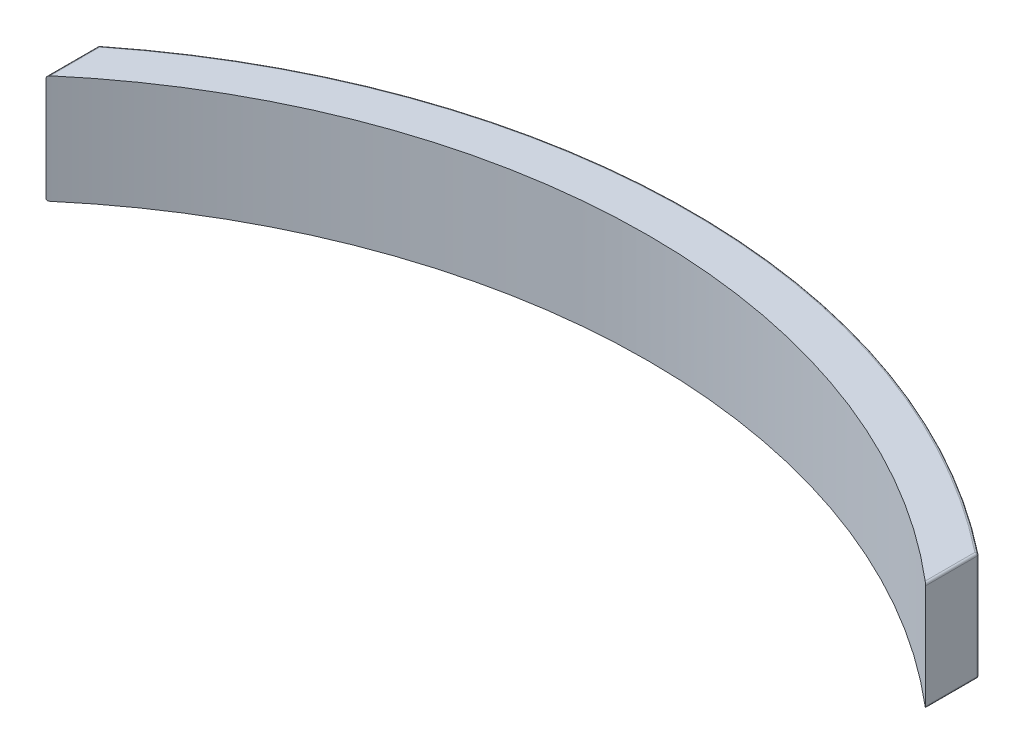
ISO-10303-21;
HEADER;
FILE_DESCRIPTION(('STEP AP214'),'2;1');
FILE_NAME('part.step','',(''),(''),'','','');
FILE_SCHEMA(('AUTOMOTIVE_DESIGN { 1 0 10303 214 1 1 1 1 }'));
ENDSEC;
DATA;
#1=APPLICATION_CONTEXT('core data for automotive mechanical design processes');
#2=APPLICATION_PROTOCOL_DEFINITION('international standard','automotive_design',2000,#1);
#3=PRODUCT_CONTEXT('',#1,'mechanical');
#4=PRODUCT('Part','Part','',(#3));
#5=PRODUCT_RELATED_PRODUCT_CATEGORY('part','',(#4));
#6=PRODUCT_DEFINITION_FORMATION('','',#4);
#7=PRODUCT_DEFINITION_CONTEXT('part definition',#1,'design');
#8=PRODUCT_DEFINITION('design','',#6,#7);
#9=PRODUCT_DEFINITION_SHAPE('','',#8);
#10=(LENGTH_UNIT() NAMED_UNIT(*) SI_UNIT(.MILLI.,.METRE.));
#11=(NAMED_UNIT(*) PLANE_ANGLE_UNIT() SI_UNIT($,.RADIAN.));
#12=(NAMED_UNIT(*) SI_UNIT($,.STERADIAN.) SOLID_ANGLE_UNIT());
#13=UNCERTAINTY_MEASURE_WITH_UNIT(LENGTH_MEASURE(1.E-05),#10,'distance_accuracy_value','');
#14=(GEOMETRIC_REPRESENTATION_CONTEXT(3) GLOBAL_UNCERTAINTY_ASSIGNED_CONTEXT((#13)) GLOBAL_UNIT_ASSIGNED_CONTEXT((#10,
#11,#12)) REPRESENTATION_CONTEXT('',''));
#15=CARTESIAN_POINT('',(0.,0.,0.));
#16=DIRECTION('',(0.,0.,1.));
#17=DIRECTION('',(1.,0.,0.));
#18=AXIS2_PLACEMENT_3D('',#15,#16,#17);
#19=CARTESIAN_POINT('',(51.3662048797983,12.7,-4.15000947331262));
#20=DIRECTION('',(-1.,0.,0.));
#21=DIRECTION('',(0.,0.,1.));
#22=AXIS2_PLACEMENT_3D('',#19,#20,#21);
#23=PLANE('',#22);
#24=DIRECTION('',(0.,1.,0.));
#25=VECTOR('',#24,1.);
#26=CARTESIAN_POINT('',(51.3662048797983,0.,-58.4729008963283));
#27=LINE('',#26,#25);
#28=CARTESIAN_POINT('',(51.3662048797983,0.254000000000001,-58.4729008963283));
#29=VERTEX_POINT('',#28);
#30=CARTESIAN_POINT('',(51.3662048797983,12.446,-58.4729008963283));
#31=VERTEX_POINT('',#30);
#32=EDGE_CURVE('E124',#29,#31,#27,.T.);
#33=ORIENTED_EDGE('',*,*,#32,.F.);
#34=DIRECTION('',(0.,0.,-1.));
#35=VECTOR('',#34,1.);
#36=CARTESIAN_POINT('',(51.3662048797983,0.254000000000001,-64.2973141915476));
#37=LINE('',#36,#35);
#38=CARTESIAN_POINT('',(51.3662048797983,0.254000000000001,-64.4994118448031));
#39=VERTEX_POINT('',#38);
#40=EDGE_CURVE('E258',#29,#39,#37,.T.);
#41=ORIENTED_EDGE('',*,*,#40,.T.);
#42=DIRECTION('',(0.,-1.,0.));
#43=VECTOR('',#42,1.);
#44=CARTESIAN_POINT('',(51.3662048797983,12.7,-64.4994118448031));
#45=LINE('',#44,#43);
#46=CARTESIAN_POINT('',(51.3662048797983,12.446,-64.4994118448031));
#47=VERTEX_POINT('',#46);
#48=EDGE_CURVE('E256',#39,#47,#45,.F.);
#49=ORIENTED_EDGE('',*,*,#48,.T.);
#50=DIRECTION('',(0.,0.,-1.));
#51=VECTOR('',#50,1.);
#52=CARTESIAN_POINT('',(51.3662048797983,12.446,-4.15000947331262));
#53=LINE('',#52,#51);
#54=EDGE_CURVE('E127',#47,#31,#53,.F.);
#55=ORIENTED_EDGE('',*,*,#54,.T.);
#56=EDGE_LOOP('',(#33,#41,#49,#55));
#57=FACE_BOUND('',#56,.T.);
#58=ADVANCED_FACE('F37',(#57),#23,.F.);
#59=CARTESIAN_POINT('',(0.,12.7,0.));
#60=DIRECTION('',(0.,-1.,0.));
#61=DIRECTION('',(0.,0.,-1.));
#62=AXIS2_PLACEMENT_3D('',#59,#60,#61);
#63=CYLINDRICAL_SURFACE('',#62,82.55);
#64=CARTESIAN_POINT('',(0.,0.254000000000001,0.));
#65=DIRECTION('',(0.,-1.,0.));
#66=DIRECTION('',(0.,0.,-1.));
#67=AXIS2_PLACEMENT_3D('',#64,#65,#66);
#68=CIRCLE('',#67,82.55);
#69=CARTESIAN_POINT('',(51.2699585985631,0.254000000000001,-64.6984841035834));
#70=VERTEX_POINT('',#69);
#71=CARTESIAN_POINT('',(-51.269958598563,0.254000000000001,-64.6984841035834));
#72=VERTEX_POINT('',#71);
#73=EDGE_CURVE('E132',#70,#72,#68,.F.);
#74=ORIENTED_EDGE('',*,*,#73,.T.);
#75=DIRECTION('',(0.,-1.,0.));
#76=VECTOR('',#75,1.);
#77=CARTESIAN_POINT('',(-51.269958598563,12.7,-64.6984841035834));
#78=LINE('',#77,#76);
#79=CARTESIAN_POINT('',(-51.269958598563,12.446,-64.6984841035834));
#80=VERTEX_POINT('',#79);
#81=EDGE_CURVE('E260',#72,#80,#78,.F.);
#82=ORIENTED_EDGE('',*,*,#81,.T.);
#83=CARTESIAN_POINT('',(0.,12.446,0.));
#84=DIRECTION('',(0.,-1.,0.));
#85=DIRECTION('',(0.,0.,-1.));
#86=AXIS2_PLACEMENT_3D('',#83,#84,#85);
#87=CIRCLE('',#86,82.55);
#88=CARTESIAN_POINT('',(51.2699585985631,12.446,-64.6984841035834));
#89=VERTEX_POINT('',#88);
#90=EDGE_CURVE('E277',#80,#89,#87,.T.);
#91=ORIENTED_EDGE('',*,*,#90,.T.);
#92=DIRECTION('',(0.,-1.,0.));
#93=VECTOR('',#92,1.);
#94=CARTESIAN_POINT('',(51.2699585985631,12.7,-64.6984841035834));
#95=LINE('',#94,#93);
#96=EDGE_CURVE('E281',#89,#70,#95,.T.);
#97=ORIENTED_EDGE('',*,*,#96,.T.);
#98=EDGE_LOOP('',(#74,#82,#91,#97));
#99=FACE_BOUND('',#98,.T.);
#100=ADVANCED_FACE('F216',(#99),#63,.T.);
#101=CARTESIAN_POINT('',(-51.3662048797982,12.7,-4.15000947331263));
#102=DIRECTION('',(1.,0.,0.));
#103=DIRECTION('',(0.,0.,-1.));
#104=AXIS2_PLACEMENT_3D('',#101,#102,#103);
#105=PLANE('',#104);
#106=DIRECTION('',(0.,-1.,0.));
#107=VECTOR('',#106,1.);
#108=CARTESIAN_POINT('',(-51.3662048797982,12.7,-64.4994118448031));
#109=LINE('',#108,#107);
#110=CARTESIAN_POINT('',(-51.3662048797982,12.446,-64.4994118448031));
#111=VERTEX_POINT('',#110);
#112=CARTESIAN_POINT('',(-51.3662048797982,0.254000000000001,-64.4994118448031));
#113=VERTEX_POINT('',#112);
#114=EDGE_CURVE('E275',#111,#113,#109,.T.);
#115=ORIENTED_EDGE('',*,*,#114,.T.);
#116=DIRECTION('',(0.,0.,1.));
#117=VECTOR('',#116,1.);
#118=CARTESIAN_POINT('',(-51.3662048797982,0.254000000000001,-58.4729008963283));
#119=LINE('',#118,#117);
#120=CARTESIAN_POINT('',(-51.3662048797982,0.254000000000001,-58.4729008963283));
#121=VERTEX_POINT('',#120);
#122=EDGE_CURVE('E247',#113,#121,#119,.T.);
#123=ORIENTED_EDGE('',*,*,#122,.T.);
#124=DIRECTION('',(0.,1.,0.));
#125=VECTOR('',#124,1.);
#126=CARTESIAN_POINT('',(-51.3662048797982,0.,-58.4729008963283));
#127=LINE('',#126,#125);
#128=CARTESIAN_POINT('',(-51.3662048797982,12.446,-58.4729008963283));
#129=VERTEX_POINT('',#128);
#130=EDGE_CURVE('E133',#121,#129,#127,.T.);
#131=ORIENTED_EDGE('',*,*,#130,.T.);
#132=DIRECTION('',(0.,0.,1.));
#133=VECTOR('',#132,1.);
#134=CARTESIAN_POINT('',(-51.3662048797982,12.446,-4.15000947331263));
#135=LINE('',#134,#133);
#136=EDGE_CURVE('E126',#129,#111,#135,.F.);
#137=ORIENTED_EDGE('',*,*,#136,.T.);
#138=EDGE_LOOP('',(#115,#123,#131,#137));
#139=FACE_BOUND('',#138,.T.);
#140=ADVANCED_FACE('F222',(#139),#105,.F.);
#141=CARTESIAN_POINT('',(0.,12.7,0.));
#142=DIRECTION('',(0.,-1.,0.));
#143=DIRECTION('',(0.,0.,-1.));
#144=AXIS2_PLACEMENT_3D('',#141,#142,#143);
#145=PLANE('',#144);
#146=DIRECTION('',(0.,0.,-1.));
#147=VECTOR('',#146,1.);
#148=CARTESIAN_POINT('',(51.1122048797983,12.7,0.));
#149=LINE('',#148,#147);
#150=CARTESIAN_POINT('',(51.1122048797983,12.7,-58.6899288749966));
#151=VERTEX_POINT('',#150);
#152=CARTESIAN_POINT('',(51.1122048797983,12.7,-64.4994118448031));
#153=VERTEX_POINT('',#152);
#154=EDGE_CURVE('E130',#151,#153,#149,.T.);
#155=ORIENTED_EDGE('',*,*,#154,.T.);
#156=CARTESIAN_POINT('',(0.,12.7,0.));
#157=DIRECTION('',(0.,-1.,0.));
#158=DIRECTION('',(0.,0.,-1.));
#159=AXIS2_PLACEMENT_3D('',#156,#157,#158);
#160=CIRCLE('',#159,82.296);
#161=CARTESIAN_POINT('',(-51.1122048797982,12.7,-64.4994118448031));
#162=VERTEX_POINT('',#161);
#163=EDGE_CURVE('E12',#153,#162,#160,.F.);
#164=ORIENTED_EDGE('',*,*,#163,.T.);
#165=DIRECTION('',(0.,0.,1.));
#166=VECTOR('',#165,1.);
#167=CARTESIAN_POINT('',(-51.1122048797982,12.7,0.));
#168=LINE('',#167,#166);
#169=CARTESIAN_POINT('',(-51.1122048797982,12.7,-58.6899288749966));
#170=VERTEX_POINT('',#169);
#171=EDGE_CURVE('E47',#162,#170,#168,.T.);
#172=ORIENTED_EDGE('',*,*,#171,.T.);
#173=CARTESIAN_POINT('',(0.,12.7,1.38669668837266));
#174=DIRECTION('',(0.,1.,0.));
#175=DIRECTION('',(0.,0.,1.));
#176=AXIS2_PLACEMENT_3D('',#173,#174,#175);
#177=CIRCLE('',#176,78.8774899876748);
#178=EDGE_CURVE('E121',#151,#170,#177,.T.);
#179=ORIENTED_EDGE('',*,*,#178,.F.);
#180=EDGE_LOOP('',(#155,#164,#172,#179));
#181=FACE_BOUND('',#180,.T.);
#182=ADVANCED_FACE('F129',(#181),#145,.F.);
#183=CARTESIAN_POINT('',(0.,0.,0.));
#184=DIRECTION('',(0.,-1.,0.));
#185=DIRECTION('',(0.,0.,-1.));
#186=AXIS2_PLACEMENT_3D('',#183,#184,#185);
#187=PLANE('',#186);
#188=CARTESIAN_POINT('',(0.,0.,0.));
#189=DIRECTION('',(0.,-1.,0.));
#190=DIRECTION('',(0.,0.,-1.));
#191=AXIS2_PLACEMENT_3D('',#188,#189,#190);
#192=CIRCLE('',#191,82.296);
#193=CARTESIAN_POINT('',(-51.1122048797982,0.,-64.4994118448031));
#194=VERTEX_POINT('',#193);
#195=CARTESIAN_POINT('',(51.1122048797983,0.,-64.4994118448031));
#196=VERTEX_POINT('',#195);
#197=EDGE_CURVE('E136',#194,#196,#192,.T.);
#198=ORIENTED_EDGE('',*,*,#197,.T.);
#199=DIRECTION('',(0.,0.,-1.));
#200=VECTOR('',#199,1.);
#201=CARTESIAN_POINT('',(51.1122048797983,0.,-58.4729008963283));
#202=LINE('',#201,#200);
#203=CARTESIAN_POINT('',(51.1122048797983,0.,-58.6899288749966));
#204=VERTEX_POINT('',#203);
#205=EDGE_CURVE('E265',#196,#204,#202,.F.);
#206=ORIENTED_EDGE('',*,*,#205,.T.);
#207=CARTESIAN_POINT('',(0.,0.,1.38669668837266));
#208=DIRECTION('',(0.,1.,0.));
#209=DIRECTION('',(0.,0.,1.));
#210=AXIS2_PLACEMENT_3D('',#207,#208,#209);
#211=CIRCLE('',#210,78.8774899876748);
#212=CARTESIAN_POINT('',(-51.1122048797982,0.,-58.6899288749966));
#213=VERTEX_POINT('',#212);
#214=EDGE_CURVE('E306',#204,#213,#211,.T.);
#215=ORIENTED_EDGE('',*,*,#214,.T.);
#216=DIRECTION('',(0.,0.,1.));
#217=VECTOR('',#216,1.);
#218=CARTESIAN_POINT('',(-51.1122048797982,0.,-64.2973141915477));
#219=LINE('',#218,#217);
#220=EDGE_CURVE('E246',#213,#194,#219,.F.);
#221=ORIENTED_EDGE('',*,*,#220,.T.);
#222=EDGE_LOOP('',(#198,#206,#215,#221));
#223=FACE_BOUND('',#222,.T.);
#224=ADVANCED_FACE('F157',(#223),#187,.T.);
#225=CARTESIAN_POINT('',(0.,0.,1.38669668837266));
#226=DIRECTION('',(0.,1.,0.));
#227=DIRECTION('',(0.,0.,1.));
#228=AXIS2_PLACEMENT_3D('',#225,#226,#227);
#229=CYLINDRICAL_SURFACE('',#228,78.8774899876748);
#230=ORIENTED_EDGE('',*,*,#214,.F.);
#231=CARTESIAN_POINT('',(51.1122048797983,0.,-58.6899288749966));
#232=CARTESIAN_POINT('',(51.1285005322446,1.24339196526637E-05,-58.6760652050084));
#233=CARTESIAN_POINT('',(51.1448124736468,0.00157030515408576,-58.6621754543319));
#234=CARTESIAN_POINT('',(51.1771727761479,0.00788876089832517,-58.6345983271632));
#235=CARTESIAN_POINT('',(51.1932185731452,0.0126711663227266,-58.6209129831774));
#236=CARTESIAN_POINT('',(51.2229783833175,0.0249199413864458,-58.5955111720721));
#237=CARTESIAN_POINT('',(51.2367665739464,0.0320763178060075,-58.5837333939146));
#238=CARTESIAN_POINT('',(51.263269552765,0.0491988191725718,-58.561079941491));
#239=CARTESIAN_POINT('',(51.2759869791822,0.0591577590861268,-58.5502020512444));
#240=CARTESIAN_POINT('',(51.2970265878991,0.0793097629537153,-58.532195452466));
#241=CARTESIAN_POINT('',(51.3056810538956,0.0889032083824871,-58.5247849341728));
#242=CARTESIAN_POINT('',(51.3217144417929,0.109796779516485,-58.5110508861492));
#243=CARTESIAN_POINT('',(51.3290945971183,0.121095234835503,-58.5047263053571));
#244=CARTESIAN_POINT('',(51.3409930270559,0.143098832230235,-58.4945266795741));
#245=CARTESIAN_POINT('',(51.3457873286396,0.153544607854242,-58.4904156299447));
#246=CARTESIAN_POINT('',(51.3539939749652,0.175330025015601,-58.4833772952153));
#247=CARTESIAN_POINT('',(51.3574090105342,0.186667874029333,-58.4804477052078));
#248=CARTESIAN_POINT('',(51.3620500652299,0.207325288265903,-58.4764660026636));
#249=CARTESIAN_POINT('',(51.3635966002136,0.21652080976371,-58.4751390195016));
#250=CARTESIAN_POINT('',(51.3656794098582,0.235140242428436,-58.4733518082657));
#251=CARTESIAN_POINT('',(51.3662121144532,0.244564842755139,-58.4728946431391));
#252=CARTESIAN_POINT('',(51.3662048797983,0.253999999999999,-58.4729008963283));
#253=B_SPLINE_CURVE_WITH_KNOTS('',3,(#231,#232,#233,#234,#235,#236,#237,#238,#239,#240,#241,
#242,#243,#244,#245,#246,#247,#248,#249,#250,#251,#252),.UNSPECIFIED.,.F.,.F.,(4,2,2,2,2,2,2,2,
2,2,4),(0.,0.0641792203809252,0.128797169253989,0.187064106620008,0.245183002929683,
0.289707756629803,0.334189169579471,0.370662739061786,0.407064804041301,0.435227317153347,
0.463488818546699),.UNSPECIFIED.);
#254=EDGE_CURVE('E178',#204,#29,#253,.T.);
#255=ORIENTED_EDGE('',*,*,#254,.T.);
#256=ORIENTED_EDGE('',*,*,#32,.T.);
#257=CARTESIAN_POINT('',(51.3662048797983,12.446,-58.4729008963283));
#258=CARTESIAN_POINT('',(51.3662235731126,12.4578897644025,-58.4728847492527));
#259=CARTESIAN_POINT('',(51.3653713691766,12.4697554717657,-58.4736161435555));
#260=CARTESIAN_POINT('',(51.3620847364544,12.4930147169489,-58.4764362581844));
#261=CARTESIAN_POINT('',(51.3596618521387,12.5044110596757,-58.4785150749642));
#262=CARTESIAN_POINT('',(51.353395889502,12.5264671115858,-58.4838901900938));
#263=CARTESIAN_POINT('',(51.3495557836074,12.5371283074878,-58.487183940281));
#264=CARTESIAN_POINT('',(51.3406695472803,12.5575533498165,-58.4948038920086));
#265=CARTESIAN_POINT('',(51.3356211678078,12.5673154752533,-58.4991320188811));
#266=CARTESIAN_POINT('',(51.3226566768546,12.5889492355454,-58.510243409875));
#267=CARTESIAN_POINT('',(51.314348576575,12.6004140596755,-58.5173615663491));
#268=CARTESIAN_POINT('',(51.2964271404291,12.6214121807187,-58.5327085929748));
#269=CARTESIAN_POINT('',(51.2868117905468,12.6309424395207,-58.5409391768724));
#270=CARTESIAN_POINT('',(51.2636637321227,12.6506218820549,-58.5607428031427));
#271=CARTESIAN_POINT('',(51.2498123762293,12.6601237148307,-58.5725854338264));
#272=CARTESIAN_POINT('',(51.2211103937351,12.6760556827711,-58.597106416134));
#273=CARTESIAN_POINT('',(51.2062582005003,12.6824808683029,-58.6097860773181));
#274=CARTESIAN_POINT('',(51.1782070364194,12.6916514779126,-58.6337151644184));
#275=CARTESIAN_POINT('',(51.1650832994177,12.6947971979632,-58.6449031123573));
#276=CARTESIAN_POINT('',(51.1387072004215,12.6989624196142,-58.6673735816552));
#277=CARTESIAN_POINT('',(51.1254559552605,12.6999936150761,-58.6786552345351));
#278=CARTESIAN_POINT('',(51.1122048797983,12.7,-58.6899288749966));
#279=B_SPLINE_CURVE_WITH_KNOTS('',3,(#257,#258,#259,#260,#261,#262,#263,#264,#265,#266,#267,
#268,#269,#270,#271,#272,#273,#274,#275,#276,#277,#278),.UNSPECIFIED.,.F.,.F.,(4,2,2,2,2,2,2,2,
2,2,4),(0.,0.0355782470921171,0.0708979149732197,0.106143921858325,0.141456051815153,
0.188739473084153,0.236096585057786,0.297429372512318,0.358860501838437,0.411322343790664,
0.463493267227226),.UNSPECIFIED.);
#280=EDGE_CURVE('E117',#31,#151,#279,.T.);
#281=ORIENTED_EDGE('',*,*,#280,.T.);
#282=ORIENTED_EDGE('',*,*,#178,.T.);
#283=CARTESIAN_POINT('',(-51.1122048797982,12.7,-58.6899288749966));
#284=CARTESIAN_POINT('',(-51.1285005322445,12.6999875660803,-58.6760652050085));
#285=CARTESIAN_POINT('',(-51.1448124736468,12.6984296948459,-58.6621754543319));
#286=CARTESIAN_POINT('',(-51.1771727761479,12.6921112391017,-58.6345983271632));
#287=CARTESIAN_POINT('',(-51.1932185731451,12.6873288336773,-58.6209129831775));
#288=CARTESIAN_POINT('',(-51.2229783833175,12.6750800586136,-58.5955111720722));
#289=CARTESIAN_POINT('',(-51.2367665739464,12.667923682194,-58.5837333939146));
#290=CARTESIAN_POINT('',(-51.263269552765,12.6508011808274,-58.561079941491));
#291=CARTESIAN_POINT('',(-51.2759869791821,12.6408422409139,-58.5502020512445));
#292=CARTESIAN_POINT('',(-51.297026587899,12.6206902370463,-58.532195452466));
#293=CARTESIAN_POINT('',(-51.3056810538955,12.6110967916175,-58.5247849341728));
#294=CARTESIAN_POINT('',(-51.3217144417929,12.5902032204835,-58.5110508861492));
#295=CARTESIAN_POINT('',(-51.3290945971182,12.5789047651645,-58.5047263053571));
#296=CARTESIAN_POINT('',(-51.3409930270558,12.5569011677698,-58.4945266795742));
#297=CARTESIAN_POINT('',(-51.3457873286396,12.5464553921458,-58.4904156299448));
#298=CARTESIAN_POINT('',(-51.3539939749652,12.5246699749844,-58.4833772952154));
#299=CARTESIAN_POINT('',(-51.3574090105341,12.5133321259707,-58.4804477052079));
#300=CARTESIAN_POINT('',(-51.3620500652299,12.4926747117341,-58.4764660026636));
#301=CARTESIAN_POINT('',(-51.3635966002136,12.4834791902363,-58.4751390195017));
#302=CARTESIAN_POINT('',(-51.3656794098581,12.4648597575716,-58.4733518082657));
#303=CARTESIAN_POINT('',(-51.3662121144532,12.4554351572449,-58.4728946431391));
#304=CARTESIAN_POINT('',(-51.3662048797982,12.446,-58.4729008963283));
#305=B_SPLINE_CURVE_WITH_KNOTS('',3,(#283,#284,#285,#286,#287,#288,#289,#290,#291,#292,#293,
#294,#295,#296,#297,#298,#299,#300,#301,#302,#303,#304),.UNSPECIFIED.,.F.,.F.,(4,2,2,2,2,2,2,2,
2,2,4),(0.,0.0641792203809208,0.128797169253989,0.187064106620002,0.245183002929683,
0.289707756629803,0.334189169579472,0.370662739061784,0.407064804041299,0.435227317153349,
0.463488818546698),.UNSPECIFIED.);
#306=EDGE_CURVE('E164',#170,#129,#305,.T.);
#307=ORIENTED_EDGE('',*,*,#306,.T.);
#308=ORIENTED_EDGE('',*,*,#130,.F.);
#309=CARTESIAN_POINT('',(-51.3662048797982,0.254000000000001,-58.4729008963283));
#310=CARTESIAN_POINT('',(-51.3662235731126,0.242110235597506,-58.4728847492527));
#311=CARTESIAN_POINT('',(-51.3653713691765,0.230244528234325,-58.4736161435555));
#312=CARTESIAN_POINT('',(-51.3620847364543,0.206985283051121,-58.4764362581845));
#313=CARTESIAN_POINT('',(-51.3596618521387,0.195588940324283,-58.4785150749642));
#314=CARTESIAN_POINT('',(-51.3533958895019,0.173532888414171,-58.4838901900938));
#315=CARTESIAN_POINT('',(-51.3495557836073,0.162871692512194,-58.487183940281));
#316=CARTESIAN_POINT('',(-51.3406695472803,0.142446650183501,-58.4948038920087));
#317=CARTESIAN_POINT('',(-51.3356211678077,0.13268452474672,-58.4991320188811));
#318=CARTESIAN_POINT('',(-51.3226566768546,0.111050764454575,-58.510243409875));
#319=CARTESIAN_POINT('',(-51.3143485765749,0.0995859403245254,-58.5173615663492));
#320=CARTESIAN_POINT('',(-51.2964271404291,0.0785878192812799,-58.5327085929748));
#321=CARTESIAN_POINT('',(-51.2868117905467,0.0690575604793077,-58.5409391768725));
#322=CARTESIAN_POINT('',(-51.2636637321227,0.0493781179451198,-58.5607428031428));
#323=CARTESIAN_POINT('',(-51.2498123762292,0.0398762851692773,-58.5725854338265));
#324=CARTESIAN_POINT('',(-51.221110393735,0.023944317228918,-58.5971064161341));
#325=CARTESIAN_POINT('',(-51.2062582005003,0.0175191316970521,-58.6097860773182));
#326=CARTESIAN_POINT('',(-51.1782070364193,0.00834852208742133,-58.6337151644184));
#327=CARTESIAN_POINT('',(-51.1650832994177,0.00520280203684051,-58.6449031123573));
#328=CARTESIAN_POINT('',(-51.1387072004215,0.00103758038582657,-58.6673735816552));
#329=CARTESIAN_POINT('',(-51.1254559552604,6.38492393559678E-06,-58.6786552345351));
#330=CARTESIAN_POINT('',(-51.1122048797982,0.,-58.6899288749966));
#331=B_SPLINE_CURVE_WITH_KNOTS('',3,(#309,#310,#311,#312,#313,#314,#315,#316,#317,#318,#319,
#320,#321,#322,#323,#324,#325,#326,#327,#328,#329,#330),.UNSPECIFIED.,.F.,.F.,(4,2,2,2,2,2,2,2,
2,2,4),(0.,0.0355782470921179,0.0708979149732214,0.106143921858322,0.141456051815154,
0.188739473084153,0.236096585057804,0.297429372512332,0.358860501838451,0.411322343790663,
0.463493267227221),.UNSPECIFIED.);
#332=EDGE_CURVE('E172',#121,#213,#331,.T.);
#333=ORIENTED_EDGE('',*,*,#332,.T.);
#334=EDGE_LOOP('',(#230,#255,#256,#281,#282,#307,#308,#333));
#335=FACE_BOUND('',#334,.T.);
#336=ADVANCED_FACE('F120',(#335),#229,.F.);
#337=CARTESIAN_POINT('',(0.,0.254000000000001,0.));
#338=DIRECTION('',(0.,-1.,0.));
#339=DIRECTION('',(0.,0.,-1.));
#340=AXIS2_PLACEMENT_3D('',#337,#338,#339);
#341=TOROIDAL_SURFACE('',#340,82.296,0.254);
#342=ORIENTED_EDGE('',*,*,#197,.F.);
#343=CARTESIAN_POINT('',(-51.1122048797982,0.254000000000001,-64.4994118448031));
#344=DIRECTION('',(0.783749050315971,0.,-0.62107763293232));
#345=DIRECTION('',(-0.62107763293232,0.,-0.783749050315971));
#346=AXIS2_PLACEMENT_3D('',#343,#344,#345);
#347=CIRCLE('',#346,0.254);
#348=EDGE_CURVE('E235',#194,#72,#347,.T.);
#349=ORIENTED_EDGE('',*,*,#348,.T.);
#350=ORIENTED_EDGE('',*,*,#73,.F.);
#351=CARTESIAN_POINT('',(51.1122048797983,0.254000000000001,-64.4994118448031));
#352=DIRECTION('',(0.78374905031597,0.,0.621077632932321));
#353=DIRECTION('',(0.621077632932321,0.,-0.78374905031597));
#354=AXIS2_PLACEMENT_3D('',#351,#352,#353);
#355=CIRCLE('',#354,0.254);
#356=EDGE_CURVE('E238',#70,#196,#355,.F.);
#357=ORIENTED_EDGE('',*,*,#356,.T.);
#358=EDGE_LOOP('',(#342,#349,#350,#357));
#359=FACE_BOUND('',#358,.T.);
#360=ADVANCED_FACE('F156',(#359),#341,.T.);
#361=CARTESIAN_POINT('',(51.1122048797983,12.446,0.));
#362=DIRECTION('',(0.,0.,-1.));
#363=DIRECTION('',(-1.,0.,0.));
#364=AXIS2_PLACEMENT_3D('',#361,#362,#363);
#365=CYLINDRICAL_SURFACE('',#364,0.254);
#366=ORIENTED_EDGE('',*,*,#54,.F.);
#367=CARTESIAN_POINT('',(51.1122048797983,12.446,-64.4994118448031));
#368=DIRECTION('',(0.,0.,-1.));
#369=DIRECTION('',(-1.,0.,0.));
#370=AXIS2_PLACEMENT_3D('',#367,#368,#369);
#371=CIRCLE('',#370,0.254);
#372=EDGE_CURVE('E61',#47,#153,#371,.F.);
#373=ORIENTED_EDGE('',*,*,#372,.T.);
#374=ORIENTED_EDGE('',*,*,#154,.F.);
#375=ORIENTED_EDGE('',*,*,#280,.F.);
#376=EDGE_LOOP('',(#366,#373,#374,#375));
#377=FACE_BOUND('',#376,.T.);
#378=ADVANCED_FACE('F135',(#377),#365,.T.);
#379=CARTESIAN_POINT('',(51.1122048797983,0.254000000000001,-4.15000947331262));
#380=DIRECTION('',(0.,0.,1.));
#381=DIRECTION('',(1.,0.,0.));
#382=AXIS2_PLACEMENT_3D('',#379,#380,#381);
#383=CYLINDRICAL_SURFACE('',#382,0.254);
#384=ORIENTED_EDGE('',*,*,#254,.F.);
#385=ORIENTED_EDGE('',*,*,#205,.F.);
#386=CARTESIAN_POINT('',(51.1122048797983,0.254000000000001,-64.4994118448031));
#387=DIRECTION('',(0.,0.,-1.));
#388=DIRECTION('',(-1.,0.,0.));
#389=AXIS2_PLACEMENT_3D('',#386,#387,#388);
#390=CIRCLE('',#389,0.254);
#391=EDGE_CURVE('E42',#39,#196,#390,.T.);
#392=ORIENTED_EDGE('',*,*,#391,.F.);
#393=ORIENTED_EDGE('',*,*,#40,.F.);
#394=EDGE_LOOP('',(#384,#385,#392,#393));
#395=FACE_BOUND('',#394,.T.);
#396=ADVANCED_FACE('F39',(#395),#383,.T.);
#397=CARTESIAN_POINT('',(51.1122048797983,0.254000000000001,-64.4994118448031));
#398=DIRECTION('',(-1.,0.,0.));
#399=DIRECTION('',(0.,0.,1.));
#400=AXIS2_PLACEMENT_3D('',#397,#398,#399);
#401=SPHERICAL_SURFACE('',#400,0.254);
#402=ORIENTED_EDGE('',*,*,#391,.T.);
#403=ORIENTED_EDGE('',*,*,#356,.F.);
#404=CARTESIAN_POINT('',(51.1122048797983,0.254000000000001,-64.4994118448031));
#405=DIRECTION('',(0.,1.,0.));
#406=DIRECTION('',(0.,0.,1.));
#407=AXIS2_PLACEMENT_3D('',#404,#405,#406);
#408=CIRCLE('',#407,0.254);
#409=EDGE_CURVE('E302',#39,#70,#408,.T.);
#410=ORIENTED_EDGE('',*,*,#409,.F.);
#411=EDGE_LOOP('',(#402,#403,#410));
#412=FACE_BOUND('',#411,.T.);
#413=ADVANCED_FACE('F206',(#412),#401,.T.);
#414=CARTESIAN_POINT('',(51.1122048797983,12.7,-64.4994118448031));
#415=DIRECTION('',(0.,-1.,0.));
#416=DIRECTION('',(0.,0.,-1.));
#417=AXIS2_PLACEMENT_3D('',#414,#415,#416);
#418=CYLINDRICAL_SURFACE('',#417,0.254);
#419=CARTESIAN_POINT('',(51.1122048797983,12.446,-64.4994118448031));
#420=DIRECTION('',(0.,1.,0.));
#421=DIRECTION('',(0.,0.,1.));
#422=AXIS2_PLACEMENT_3D('',#419,#420,#421);
#423=CIRCLE('',#422,0.254);
#424=EDGE_CURVE('E300',#47,#89,#423,.T.);
#425=ORIENTED_EDGE('',*,*,#424,.F.);
#426=ORIENTED_EDGE('',*,*,#48,.F.);
#427=ORIENTED_EDGE('',*,*,#409,.T.);
#428=ORIENTED_EDGE('',*,*,#96,.F.);
#429=EDGE_LOOP('',(#425,#426,#427,#428));
#430=FACE_BOUND('',#429,.T.);
#431=ADVANCED_FACE('F203',(#430),#418,.T.);
#432=CARTESIAN_POINT('',(51.1122048797983,12.446,-64.4994118448031));
#433=DIRECTION('',(-0.621077632932321,0.,0.78374905031597));
#434=DIRECTION('',(0.78374905031597,0.,0.621077632932321));
#435=AXIS2_PLACEMENT_3D('',#432,#433,#434);
#436=SPHERICAL_SURFACE('',#435,0.254);
#437=ORIENTED_EDGE('',*,*,#372,.F.);
#438=ORIENTED_EDGE('',*,*,#424,.T.);
#439=CARTESIAN_POINT('',(51.1122048797983,12.446,-64.4994118448031));
#440=DIRECTION('',(-0.783749050315972,0.,-0.621077632932319));
#441=DIRECTION('',(-0.621077632932319,0.,0.783749050315972));
#442=AXIS2_PLACEMENT_3D('',#439,#440,#441);
#443=CIRCLE('',#442,0.254);
#444=EDGE_CURVE('E291',#153,#89,#443,.T.);
#445=ORIENTED_EDGE('',*,*,#444,.F.);
#446=EDGE_LOOP('',(#437,#438,#445));
#447=FACE_BOUND('',#446,.T.);
#448=ADVANCED_FACE('F199',(#447),#436,.T.);
#449=CARTESIAN_POINT('',(0.,12.446,0.));
#450=DIRECTION('',(0.,-1.,0.));
#451=DIRECTION('',(0.,0.,-1.));
#452=AXIS2_PLACEMENT_3D('',#449,#450,#451);
#453=TOROIDAL_SURFACE('',#452,82.296,0.254);
#454=ORIENTED_EDGE('',*,*,#444,.T.);
#455=ORIENTED_EDGE('',*,*,#90,.F.);
#456=CARTESIAN_POINT('',(-51.1122048797982,12.446,-64.4994118448031));
#457=DIRECTION('',(-0.783749050315972,0.,0.621077632932319));
#458=DIRECTION('',(0.621077632932319,0.,0.783749050315972));
#459=AXIS2_PLACEMENT_3D('',#456,#457,#458);
#460=CIRCLE('',#459,0.254);
#461=EDGE_CURVE('E290',#162,#80,#460,.T.);
#462=ORIENTED_EDGE('',*,*,#461,.F.);
#463=ORIENTED_EDGE('',*,*,#163,.F.);
#464=EDGE_LOOP('',(#454,#455,#462,#463));
#465=FACE_BOUND('',#464,.T.);
#466=ADVANCED_FACE('F195',(#465),#453,.T.);
#467=CARTESIAN_POINT('',(-51.1122048797982,12.446,0.));
#468=DIRECTION('',(0.,0.,1.));
#469=DIRECTION('',(1.,0.,0.));
#470=AXIS2_PLACEMENT_3D('',#467,#468,#469);
#471=CYLINDRICAL_SURFACE('',#470,0.254);
#472=ORIENTED_EDGE('',*,*,#306,.F.);
#473=ORIENTED_EDGE('',*,*,#171,.F.);
#474=CARTESIAN_POINT('',(-51.1122048797982,12.446,-64.4994118448031));
#475=DIRECTION('',(0.,0.,-1.));
#476=DIRECTION('',(-1.,0.,0.));
#477=AXIS2_PLACEMENT_3D('',#474,#475,#476);
#478=CIRCLE('',#477,0.254);
#479=EDGE_CURVE('E251',#111,#162,#478,.T.);
#480=ORIENTED_EDGE('',*,*,#479,.F.);
#481=ORIENTED_EDGE('',*,*,#136,.F.);
#482=EDGE_LOOP('',(#472,#473,#480,#481));
#483=FACE_BOUND('',#482,.T.);
#484=ADVANCED_FACE('F189',(#483),#471,.T.);
#485=CARTESIAN_POINT('',(-51.1122048797982,0.254000000000001,-4.15000947331263));
#486=DIRECTION('',(0.,0.,-1.));
#487=DIRECTION('',(-1.,0.,0.));
#488=AXIS2_PLACEMENT_3D('',#485,#486,#487);
#489=CYLINDRICAL_SURFACE('',#488,0.254);
#490=ORIENTED_EDGE('',*,*,#332,.F.);
#491=ORIENTED_EDGE('',*,*,#122,.F.);
#492=CARTESIAN_POINT('',(-51.1122048797982,0.254,-64.4994118448031));
#493=DIRECTION('',(0.,0.,-1.));
#494=DIRECTION('',(-1.,0.,0.));
#495=AXIS2_PLACEMENT_3D('',#492,#493,#494);
#496=CIRCLE('',#495,0.254);
#497=EDGE_CURVE('E244',#194,#113,#496,.T.);
#498=ORIENTED_EDGE('',*,*,#497,.F.);
#499=ORIENTED_EDGE('',*,*,#220,.F.);
#500=EDGE_LOOP('',(#490,#491,#498,#499));
#501=FACE_BOUND('',#500,.T.);
#502=ADVANCED_FACE('F184',(#501),#489,.T.);
#503=CARTESIAN_POINT('',(-51.1122048797982,12.446,-64.4994118448031));
#504=DIRECTION('',(0.,0.,1.));
#505=DIRECTION('',(1.,0.,0.));
#506=AXIS2_PLACEMENT_3D('',#503,#504,#505);
#507=SPHERICAL_SURFACE('',#506,0.254);
#508=ORIENTED_EDGE('',*,*,#479,.T.);
#509=ORIENTED_EDGE('',*,*,#461,.T.);
#510=CARTESIAN_POINT('',(-51.1122048797982,12.446,-64.4994118448031));
#511=DIRECTION('',(0.,1.,0.));
#512=DIRECTION('',(0.,0.,1.));
#513=AXIS2_PLACEMENT_3D('',#510,#511,#512);
#514=CIRCLE('',#513,0.254);
#515=EDGE_CURVE('E252',#111,#80,#514,.F.);
#516=ORIENTED_EDGE('',*,*,#515,.F.);
#517=EDGE_LOOP('',(#508,#509,#516));
#518=FACE_BOUND('',#517,.T.);
#519=ADVANCED_FACE('F188',(#518),#507,.T.);
#520=CARTESIAN_POINT('',(-51.1122048797982,0.254000000000001,-64.4994118448031));
#521=DIRECTION('',(1.,0.,0.));
#522=DIRECTION('',(0.,0.,-1.));
#523=AXIS2_PLACEMENT_3D('',#520,#521,#522);
#524=SPHERICAL_SURFACE('',#523,0.254);
#525=ORIENTED_EDGE('',*,*,#348,.F.);
#526=ORIENTED_EDGE('',*,*,#497,.T.);
#527=CARTESIAN_POINT('',(-51.1122048797982,0.254000000000001,-64.4994118448031));
#528=DIRECTION('',(0.,1.,0.));
#529=DIRECTION('',(0.,0.,1.));
#530=AXIS2_PLACEMENT_3D('',#527,#528,#529);
#531=CIRCLE('',#530,0.254);
#532=EDGE_CURVE('E255',#72,#113,#531,.T.);
#533=ORIENTED_EDGE('',*,*,#532,.F.);
#534=EDGE_LOOP('',(#525,#526,#533));
#535=FACE_BOUND('',#534,.T.);
#536=ADVANCED_FACE('F254',(#535),#524,.T.);
#537=CARTESIAN_POINT('',(-51.1122048797982,12.7,-64.4994118448031));
#538=DIRECTION('',(0.,-1.,0.));
#539=DIRECTION('',(0.,0.,-1.));
#540=AXIS2_PLACEMENT_3D('',#537,#538,#539);
#541=CYLINDRICAL_SURFACE('',#540,0.254);
#542=ORIENTED_EDGE('',*,*,#515,.T.);
#543=ORIENTED_EDGE('',*,*,#81,.F.);
#544=ORIENTED_EDGE('',*,*,#532,.T.);
#545=ORIENTED_EDGE('',*,*,#114,.F.);
#546=EDGE_LOOP('',(#542,#543,#544,#545));
#547=FACE_BOUND('',#546,.T.);
#548=ADVANCED_FACE('F294',(#547),#541,.T.);
#549=CLOSED_SHELL('',(#58,#100,#140,#182,#224,#336,#360,#378,#396,#413,#431,#448,#466,#484,#502,
#519,#536,#548));
#550=MANIFOLD_SOLID_BREP('B2',#549);
#551=ADVANCED_BREP_SHAPE_REPRESENTATION('',(#18,#550),#14);
#552=SHAPE_DEFINITION_REPRESENTATION(#9,#551);
ENDSEC;
END-ISO-10303-21;
